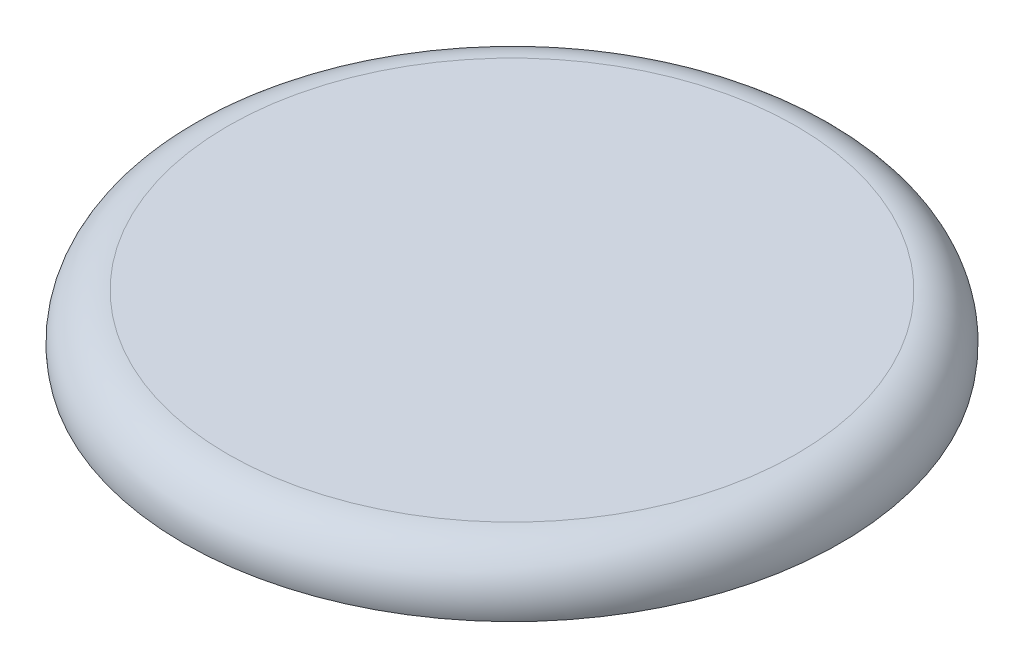
ISO-10303-21;
HEADER;
FILE_DESCRIPTION(('STEP AP214'),'2;1');
FILE_NAME('part.step','',(''),(''),'','','');
FILE_SCHEMA(('AUTOMOTIVE_DESIGN { 1 0 10303 214 1 1 1 1 }'));
ENDSEC;
DATA;
#1=APPLICATION_CONTEXT('core data for automotive mechanical design processes');
#2=APPLICATION_PROTOCOL_DEFINITION('international standard','automotive_design',2000,#1);
#3=PRODUCT_CONTEXT('',#1,'mechanical');
#4=PRODUCT('Part','Part','',(#3));
#5=PRODUCT_RELATED_PRODUCT_CATEGORY('part','',(#4));
#6=PRODUCT_DEFINITION_FORMATION('','',#4);
#7=PRODUCT_DEFINITION_CONTEXT('part definition',#1,'design');
#8=PRODUCT_DEFINITION('design','',#6,#7);
#9=PRODUCT_DEFINITION_SHAPE('','',#8);
#10=(LENGTH_UNIT() NAMED_UNIT(*) SI_UNIT(.MILLI.,.METRE.));
#11=(NAMED_UNIT(*) PLANE_ANGLE_UNIT() SI_UNIT($,.RADIAN.));
#12=(NAMED_UNIT(*) SI_UNIT($,.STERADIAN.) SOLID_ANGLE_UNIT());
#13=UNCERTAINTY_MEASURE_WITH_UNIT(LENGTH_MEASURE(1.E-05),#10,'distance_accuracy_value','');
#14=(GEOMETRIC_REPRESENTATION_CONTEXT(3) GLOBAL_UNCERTAINTY_ASSIGNED_CONTEXT((#13)) GLOBAL_UNIT_ASSIGNED_CONTEXT((#10,
#11,#12)) REPRESENTATION_CONTEXT('',''));
#15=CARTESIAN_POINT('',(0.,0.,0.));
#16=DIRECTION('',(0.,0.,1.));
#17=DIRECTION('',(1.,0.,0.));
#18=AXIS2_PLACEMENT_3D('',#15,#16,#17);
#19=CARTESIAN_POINT('',(0.,0.,0.));
#20=DIRECTION('',(0.,1.,0.));
#21=DIRECTION('',(0.,0.,1.));
#22=AXIS2_PLACEMENT_3D('',#19,#20,#21);
#23=PLANE('',#22);
#24=CARTESIAN_POINT('',(0.,0.,0.));
#25=DIRECTION('',(0.,1.,0.));
#26=DIRECTION('',(0.,0.,1.));
#27=AXIS2_PLACEMENT_3D('',#24,#25,#26);
#28=CIRCLE('',#27,62.6510284346495);
#29=CARTESIAN_POINT('',(0.,0.,62.6510284346495));
#30=VERTEX_POINT('',#29);
#31=EDGE_CURVE('E10',#30,#30,#28,.T.);
#32=ORIENTED_EDGE('',*,*,#31,.T.);
#33=EDGE_LOOP('',(#32));
#34=FACE_BOUND('',#33,.T.);
#35=ADVANCED_FACE('F45',(#34),#23,.T.);
#36=CARTESIAN_POINT('',(0.,-10.,0.));
#37=DIRECTION('',(0.,1.,0.));
#38=DIRECTION('',(0.,0.,1.));
#39=AXIS2_PLACEMENT_3D('',#36,#37,#38);
#40=TOROIDAL_SURFACE('',#39,62.6510284346495,10.);
#41=CARTESIAN_POINT('',(0.,-12.0791169081775,0.));
#42=DIRECTION('',(0.,1.,0.));
#43=DIRECTION('',(0.,0.,1.));
#44=AXIS2_PLACEMENT_3D('',#41,#42,#43);
#45=CIRCLE('',#44,72.4325044419875);
#46=CARTESIAN_POINT('',(0.,-12.0791169081775,72.4325044419875));
#47=VERTEX_POINT('',#46);
#48=EDGE_CURVE('E60',#47,#47,#45,.F.);
#49=ORIENTED_EDGE('',*,*,#48,.F.);
#50=EDGE_LOOP('',(#49));
#51=FACE_BOUND('',#50,.T.);
#52=ORIENTED_EDGE('',*,*,#31,.F.);
#53=EDGE_LOOP('',(#52));
#54=FACE_BOUND('',#53,.T.);
#55=ADVANCED_FACE('F47',(#51,#54),#40,.T.);
#56=CARTESIAN_POINT('',(0.,-12.0791169081775,0.));
#57=DIRECTION('',(0.,1.,0.));
#58=DIRECTION('',(0.,0.,1.));
#59=AXIS2_PLACEMENT_3D('',#56,#57,#58);
#60=PLANE('',#59);
#61=ORIENTED_EDGE('',*,*,#48,.T.);
#62=EDGE_LOOP('',(#61));
#63=FACE_BOUND('',#62,.T.);
#64=CARTESIAN_POINT('',(0.,-12.0791169081775,0.));
#65=DIRECTION('',(0.,1.,0.));
#66=DIRECTION('',(0.,0.,1.));
#67=AXIS2_PLACEMENT_3D('',#64,#65,#66);
#68=CIRCLE('',#67,69.5580700586878);
#69=CARTESIAN_POINT('',(0.,-12.0791169081775,69.5580700586878));
#70=VERTEX_POINT('',#69);
#71=EDGE_CURVE('E56',#70,#70,#68,.F.);
#72=ORIENTED_EDGE('',*,*,#71,.F.);
#73=EDGE_LOOP('',(#72));
#74=FACE_BOUND('',#73,.T.);
#75=ADVANCED_FACE('F66',(#63,#74),#60,.F.);
#76=CARTESIAN_POINT('',(0.,-10.,0.));
#77=DIRECTION('',(0.,1.,0.));
#78=DIRECTION('',(0.,0.,1.));
#79=AXIS2_PLACEMENT_3D('',#76,#77,#78);
#80=CONICAL_SURFACE('',#79,70.,0.20943951023932);
#81=ORIENTED_EDGE('',*,*,#71,.T.);
#82=EDGE_LOOP('',(#81));
#83=FACE_BOUND('',#82,.T.);
#84=CARTESIAN_POINT('',(0.,-10.,0.));
#85=DIRECTION('',(0.,1.,0.));
#86=DIRECTION('',(0.,0.,1.));
#87=AXIS2_PLACEMENT_3D('',#84,#85,#86);
#88=CIRCLE('',#87,70.);
#89=CARTESIAN_POINT('',(0.,-10.,70.));
#90=VERTEX_POINT('',#89);
#91=EDGE_CURVE('E52',#90,#90,#88,.T.);
#92=ORIENTED_EDGE('',*,*,#91,.T.);
#93=EDGE_LOOP('',(#92));
#94=FACE_BOUND('',#93,.T.);
#95=ADVANCED_FACE('F75',(#83,#94),#80,.F.);
#96=CARTESIAN_POINT('',(0.,-10.,0.));
#97=DIRECTION('',(0.,1.,0.));
#98=DIRECTION('',(0.,0.,1.));
#99=AXIS2_PLACEMENT_3D('',#96,#97,#98);
#100=PLANE('',#99);
#101=ORIENTED_EDGE('',*,*,#91,.F.);
#102=EDGE_LOOP('',(#101));
#103=FACE_BOUND('',#102,.T.);
#104=ADVANCED_FACE('F83',(#103),#100,.F.);
#105=CLOSED_SHELL('',(#35,#55,#75,#95,#104));
#106=MANIFOLD_SOLID_BREP('B2',#105);
#107=ADVANCED_BREP_SHAPE_REPRESENTATION('',(#18,#106),#14);
#108=SHAPE_DEFINITION_REPRESENTATION(#9,#107);
ENDSEC;
END-ISO-10303-21;
